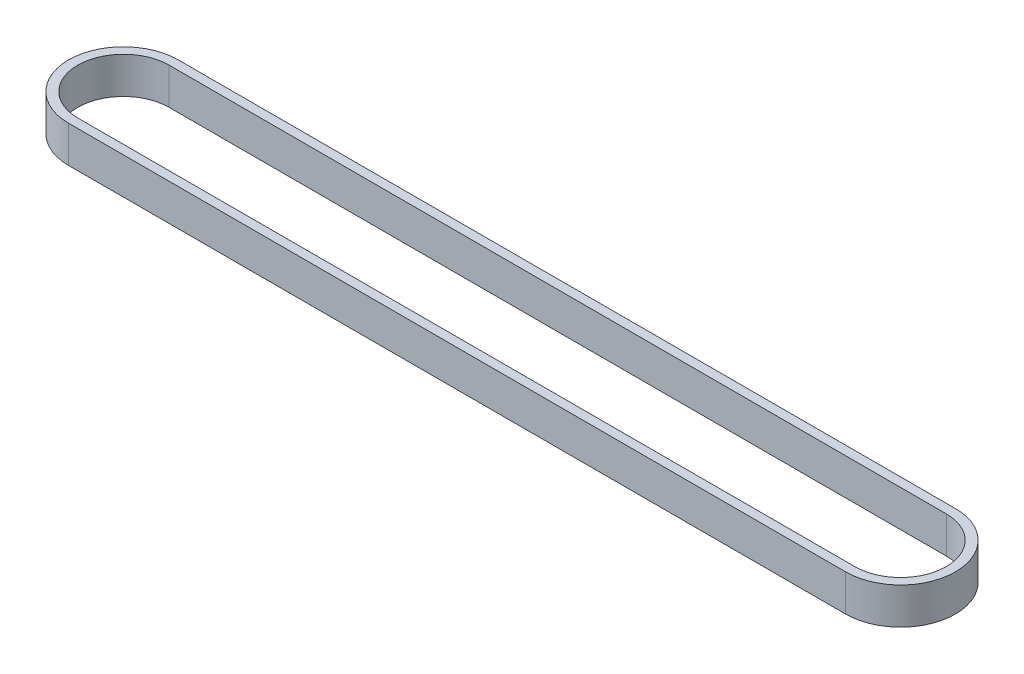
ISO-10303-21;
HEADER;
FILE_DESCRIPTION(('STEP AP214'),'2;1');
FILE_NAME('part.step','',(''),(''),'','','');
FILE_SCHEMA(('AUTOMOTIVE_DESIGN { 1 0 10303 214 1 1 1 1 }'));
ENDSEC;
DATA;
#1=APPLICATION_CONTEXT('core data for automotive mechanical design processes');
#2=APPLICATION_PROTOCOL_DEFINITION('international standard','automotive_design',2000,#1);
#3=PRODUCT_CONTEXT('',#1,'mechanical');
#4=PRODUCT('Part','Part','',(#3));
#5=PRODUCT_RELATED_PRODUCT_CATEGORY('part','',(#4));
#6=PRODUCT_DEFINITION_FORMATION('','',#4);
#7=PRODUCT_DEFINITION_CONTEXT('part definition',#1,'design');
#8=PRODUCT_DEFINITION('design','',#6,#7);
#9=PRODUCT_DEFINITION_SHAPE('','',#8);
#10=(LENGTH_UNIT() NAMED_UNIT(*) SI_UNIT(.MILLI.,.METRE.));
#11=(NAMED_UNIT(*) PLANE_ANGLE_UNIT() SI_UNIT($,.RADIAN.));
#12=(NAMED_UNIT(*) SI_UNIT($,.STERADIAN.) SOLID_ANGLE_UNIT());
#13=UNCERTAINTY_MEASURE_WITH_UNIT(LENGTH_MEASURE(1.E-05),#10,'distance_accuracy_value','');
#14=(GEOMETRIC_REPRESENTATION_CONTEXT(3) GLOBAL_UNCERTAINTY_ASSIGNED_CONTEXT((#13)) GLOBAL_UNIT_ASSIGNED_CONTEXT((#10,
#11,#12)) REPRESENTATION_CONTEXT('',''));
#15=CARTESIAN_POINT('',(0.,0.,0.));
#16=DIRECTION('',(0.,0.,1.));
#17=DIRECTION('',(1.,0.,0.));
#18=AXIS2_PLACEMENT_3D('',#15,#16,#17);
#19=CARTESIAN_POINT('',(-399.023443954952,20.,-11.0209611195785));
#20=DIRECTION('',(0.,-1.,0.));
#21=DIRECTION('',(0.,0.,-1.));
#22=AXIS2_PLACEMENT_3D('',#19,#20,#21);
#23=PLANE('',#22);
#24=CARTESIAN_POINT('',(-399.023443954952,20.,-11.0209611195785));
#25=DIRECTION('',(0.,1.,0.));
#26=DIRECTION('',(0.,0.,-1.));
#27=AXIS2_PLACEMENT_3D('',#24,#25,#26);
#28=CIRCLE('',#27,30.);
#29=CARTESIAN_POINT('',(-399.023443954952,20.,-41.0209611195785));
#30=VERTEX_POINT('',#29);
#31=CARTESIAN_POINT('',(-399.023443954952,20.,18.9790388804215));
#32=VERTEX_POINT('',#31);
#33=EDGE_CURVE('E134',#30,#32,#28,.T.);
#34=ORIENTED_EDGE('',*,*,#33,.T.);
#35=DIRECTION('',(1.,0.,0.));
#36=VECTOR('',#35,1.);
#37=CARTESIAN_POINT('',(-399.023443954952,20.,18.9790388804215));
#38=LINE('',#37,#36);
#39=CARTESIAN_POINT('',(25.9765560450475,20.,18.9790388804215));
#40=VERTEX_POINT('',#39);
#41=EDGE_CURVE('E137',#32,#40,#38,.T.);
#42=ORIENTED_EDGE('',*,*,#41,.T.);
#43=CARTESIAN_POINT('',(25.9765560450475,20.,-11.0209611195785));
#44=DIRECTION('',(0.,1.,0.));
#45=DIRECTION('',(0.,0.,-1.));
#46=AXIS2_PLACEMENT_3D('',#43,#44,#45);
#47=CIRCLE('',#46,30.);
#48=CARTESIAN_POINT('',(25.9765560450475,20.,-41.0209611195785));
#49=VERTEX_POINT('',#48);
#50=EDGE_CURVE('E140',#40,#49,#47,.T.);
#51=ORIENTED_EDGE('',*,*,#50,.T.);
#52=DIRECTION('',(-1.,0.,0.));
#53=VECTOR('',#52,1.);
#54=CARTESIAN_POINT('',(-399.023443954952,20.,-41.0209611195785));
#55=LINE('',#54,#53);
#56=EDGE_CURVE('E142',#49,#30,#55,.T.);
#57=ORIENTED_EDGE('',*,*,#56,.T.);
#58=EDGE_LOOP('',(#34,#42,#51,#57));
#59=FACE_BOUND('',#58,.T.);
#60=CARTESIAN_POINT('',(-399.023443954952,20.,-11.0209611195785));
#61=DIRECTION('',(0.,1.,0.));
#62=DIRECTION('',(0.,0.,1.));
#63=AXIS2_PLACEMENT_3D('',#60,#61,#62);
#64=CIRCLE('',#63,25.);
#65=CARTESIAN_POINT('',(-399.023443954952,20.,-36.0209611195785));
#66=VERTEX_POINT('',#65);
#67=CARTESIAN_POINT('',(-399.023443954952,20.,13.9790388804215));
#68=VERTEX_POINT('',#67);
#69=EDGE_CURVE('E98',#66,#68,#64,.T.);
#70=ORIENTED_EDGE('',*,*,#69,.F.);
#71=DIRECTION('',(-1.,0.,0.));
#72=VECTOR('',#71,1.);
#73=CARTESIAN_POINT('',(-399.023443954952,20.,-36.0209611195785));
#74=LINE('',#73,#72);
#75=CARTESIAN_POINT('',(25.9765560450475,20.,-36.0209611195785));
#76=VERTEX_POINT('',#75);
#77=EDGE_CURVE('E120',#76,#66,#74,.T.);
#78=ORIENTED_EDGE('',*,*,#77,.F.);
#79=CARTESIAN_POINT('',(25.9765560450475,20.,-11.0209611195785));
#80=DIRECTION('',(0.,1.,0.));
#81=DIRECTION('',(0.,0.,1.));
#82=AXIS2_PLACEMENT_3D('',#79,#80,#81);
#83=CIRCLE('',#82,25.);
#84=CARTESIAN_POINT('',(25.9765560450475,20.,13.9790388804215));
#85=VERTEX_POINT('',#84);
#86=EDGE_CURVE('E118',#85,#76,#83,.T.);
#87=ORIENTED_EDGE('',*,*,#86,.F.);
#88=DIRECTION('',(1.,0.,0.));
#89=VECTOR('',#88,1.);
#90=CARTESIAN_POINT('',(-399.023443954952,20.,13.9790388804215));
#91=LINE('',#90,#89);
#92=EDGE_CURVE('E106',#68,#85,#91,.T.);
#93=ORIENTED_EDGE('',*,*,#92,.F.);
#94=EDGE_LOOP('',(#70,#78,#87,#93));
#95=FACE_BOUND('',#94,.T.);
#96=ADVANCED_FACE('F33',(#59,#95),#23,.F.);
#97=CARTESIAN_POINT('',(-399.023443954952,0.,-11.0209611195785));
#98=DIRECTION('',(0.,-1.,0.));
#99=DIRECTION('',(0.,0.,-1.));
#100=AXIS2_PLACEMENT_3D('',#97,#98,#99);
#101=PLANE('',#100);
#102=CARTESIAN_POINT('',(-399.023443954952,0.,-11.0209611195785));
#103=DIRECTION('',(0.,1.,0.));
#104=DIRECTION('',(0.,0.,-1.));
#105=AXIS2_PLACEMENT_3D('',#102,#103,#104);
#106=CIRCLE('',#105,30.);
#107=CARTESIAN_POINT('',(-399.023443954952,0.,-41.0209611195785));
#108=VERTEX_POINT('',#107);
#109=CARTESIAN_POINT('',(-399.023443954952,0.,18.9790388804215));
#110=VERTEX_POINT('',#109);
#111=EDGE_CURVE('E114',#108,#110,#106,.T.);
#112=ORIENTED_EDGE('',*,*,#111,.F.);
#113=DIRECTION('',(-1.,0.,0.));
#114=VECTOR('',#113,1.);
#115=CARTESIAN_POINT('',(-399.023443954952,0.,-41.0209611195785));
#116=LINE('',#115,#114);
#117=CARTESIAN_POINT('',(25.9765560450475,0.,-41.0209611195785));
#118=VERTEX_POINT('',#117);
#119=EDGE_CURVE('E138',#118,#108,#116,.T.);
#120=ORIENTED_EDGE('',*,*,#119,.F.);
#121=CARTESIAN_POINT('',(25.9765560450475,0.,-11.0209611195785));
#122=DIRECTION('',(0.,1.,0.));
#123=DIRECTION('',(0.,0.,-1.));
#124=AXIS2_PLACEMENT_3D('',#121,#122,#123);
#125=CIRCLE('',#124,30.);
#126=CARTESIAN_POINT('',(25.9765560450475,0.,18.9790388804215));
#127=VERTEX_POINT('',#126);
#128=EDGE_CURVE('E149',#127,#118,#125,.T.);
#129=ORIENTED_EDGE('',*,*,#128,.F.);
#130=DIRECTION('',(1.,0.,0.));
#131=VECTOR('',#130,1.);
#132=CARTESIAN_POINT('',(-399.023443954952,0.,18.9790388804215));
#133=LINE('',#132,#131);
#134=EDGE_CURVE('E147',#110,#127,#133,.T.);
#135=ORIENTED_EDGE('',*,*,#134,.F.);
#136=EDGE_LOOP('',(#112,#120,#129,#135));
#137=FACE_BOUND('',#136,.T.);
#138=DIRECTION('',(-1.,0.,0.));
#139=VECTOR('',#138,1.);
#140=CARTESIAN_POINT('',(-399.023443954952,0.,-36.0209611195785));
#141=LINE('',#140,#139);
#142=CARTESIAN_POINT('',(25.9765560450475,0.,-36.0209611195785));
#143=VERTEX_POINT('',#142);
#144=CARTESIAN_POINT('',(-399.023443954952,0.,-36.0209611195785));
#145=VERTEX_POINT('',#144);
#146=EDGE_CURVE('E107',#143,#145,#141,.T.);
#147=ORIENTED_EDGE('',*,*,#146,.T.);
#148=CARTESIAN_POINT('',(-399.023443954952,0.,-11.0209611195785));
#149=DIRECTION('',(0.,1.,0.));
#150=DIRECTION('',(0.,0.,1.));
#151=AXIS2_PLACEMENT_3D('',#148,#149,#150);
#152=CIRCLE('',#151,25.);
#153=CARTESIAN_POINT('',(-399.023443954952,0.,13.9790388804215));
#154=VERTEX_POINT('',#153);
#155=EDGE_CURVE('E56',#145,#154,#152,.T.);
#156=ORIENTED_EDGE('',*,*,#155,.T.);
#157=DIRECTION('',(1.,0.,0.));
#158=VECTOR('',#157,1.);
#159=CARTESIAN_POINT('',(-399.023443954952,0.,13.9790388804215));
#160=LINE('',#159,#158);
#161=CARTESIAN_POINT('',(25.9765560450475,0.,13.9790388804215));
#162=VERTEX_POINT('',#161);
#163=EDGE_CURVE('E113',#154,#162,#160,.T.);
#164=ORIENTED_EDGE('',*,*,#163,.T.);
#165=CARTESIAN_POINT('',(25.9765560450475,0.,-11.0209611195785));
#166=DIRECTION('',(0.,1.,0.));
#167=DIRECTION('',(0.,0.,1.));
#168=AXIS2_PLACEMENT_3D('',#165,#166,#167);
#169=CIRCLE('',#168,25.);
#170=EDGE_CURVE('E126',#162,#143,#169,.T.);
#171=ORIENTED_EDGE('',*,*,#170,.T.);
#172=EDGE_LOOP('',(#147,#156,#164,#171));
#173=FACE_BOUND('',#172,.T.);
#174=ADVANCED_FACE('F167',(#137,#173),#101,.T.);
#175=CARTESIAN_POINT('',(-399.023443954952,20.,-11.0209611195785));
#176=DIRECTION('',(0.,-1.,0.));
#177=DIRECTION('',(0.,0.,-1.));
#178=AXIS2_PLACEMENT_3D('',#175,#176,#177);
#179=CYLINDRICAL_SURFACE('',#178,30.);
#180=ORIENTED_EDGE('',*,*,#111,.T.);
#181=DIRECTION('',(0.,-1.,0.));
#182=VECTOR('',#181,1.);
#183=CARTESIAN_POINT('',(-399.023443954952,20.,18.9790388804215));
#184=LINE('',#183,#182);
#185=EDGE_CURVE('E11',#32,#110,#184,.T.);
#186=ORIENTED_EDGE('',*,*,#185,.F.);
#187=ORIENTED_EDGE('',*,*,#33,.F.);
#188=DIRECTION('',(0.,-1.,0.));
#189=VECTOR('',#188,1.);
#190=CARTESIAN_POINT('',(-399.023443954952,20.,-41.0209611195785));
#191=LINE('',#190,#189);
#192=EDGE_CURVE('E144',#30,#108,#191,.T.);
#193=ORIENTED_EDGE('',*,*,#192,.T.);
#194=EDGE_LOOP('',(#180,#186,#187,#193));
#195=FACE_BOUND('',#194,.T.);
#196=ADVANCED_FACE('F35',(#195),#179,.T.);
#197=CARTESIAN_POINT('',(-399.023443954952,20.,18.9790388804215));
#198=DIRECTION('',(0.,0.,-1.));
#199=DIRECTION('',(-1.,0.,0.));
#200=AXIS2_PLACEMENT_3D('',#197,#198,#199);
#201=PLANE('',#200);
#202=ORIENTED_EDGE('',*,*,#134,.T.);
#203=DIRECTION('',(0.,-1.,0.));
#204=VECTOR('',#203,1.);
#205=CARTESIAN_POINT('',(25.9765560450475,20.,18.9790388804215));
#206=LINE('',#205,#204);
#207=EDGE_CURVE('E41',#40,#127,#206,.T.);
#208=ORIENTED_EDGE('',*,*,#207,.F.);
#209=ORIENTED_EDGE('',*,*,#41,.F.);
#210=ORIENTED_EDGE('',*,*,#185,.T.);
#211=EDGE_LOOP('',(#202,#208,#209,#210));
#212=FACE_BOUND('',#211,.T.);
#213=ADVANCED_FACE('F177',(#212),#201,.F.);
#214=CARTESIAN_POINT('',(25.9765560450475,20.,-11.0209611195785));
#215=DIRECTION('',(0.,-1.,0.));
#216=DIRECTION('',(0.,0.,-1.));
#217=AXIS2_PLACEMENT_3D('',#214,#215,#216);
#218=CYLINDRICAL_SURFACE('',#217,30.);
#219=ORIENTED_EDGE('',*,*,#128,.T.);
#220=DIRECTION('',(0.,-1.,0.));
#221=VECTOR('',#220,1.);
#222=CARTESIAN_POINT('',(25.9765560450475,20.,-41.0209611195785));
#223=LINE('',#222,#221);
#224=EDGE_CURVE('E154',#49,#118,#223,.T.);
#225=ORIENTED_EDGE('',*,*,#224,.F.);
#226=ORIENTED_EDGE('',*,*,#50,.F.);
#227=ORIENTED_EDGE('',*,*,#207,.T.);
#228=EDGE_LOOP('',(#219,#225,#226,#227));
#229=FACE_BOUND('',#228,.T.);
#230=ADVANCED_FACE('F161',(#229),#218,.T.);
#231=CARTESIAN_POINT('',(-399.023443954952,20.,-41.0209611195785));
#232=DIRECTION('',(0.,0.,1.));
#233=DIRECTION('',(1.,0.,0.));
#234=AXIS2_PLACEMENT_3D('',#231,#232,#233);
#235=PLANE('',#234);
#236=ORIENTED_EDGE('',*,*,#119,.T.);
#237=ORIENTED_EDGE('',*,*,#192,.F.);
#238=ORIENTED_EDGE('',*,*,#56,.F.);
#239=ORIENTED_EDGE('',*,*,#224,.T.);
#240=EDGE_LOOP('',(#236,#237,#238,#239));
#241=FACE_BOUND('',#240,.T.);
#242=ADVANCED_FACE('F171',(#241),#235,.F.);
#243=CARTESIAN_POINT('',(-399.023443954952,20.,-11.0209611195785));
#244=DIRECTION('',(0.,-1.,0.));
#245=DIRECTION('',(0.,0.,-1.));
#246=AXIS2_PLACEMENT_3D('',#243,#244,#245);
#247=CYLINDRICAL_SURFACE('',#246,25.);
#248=ORIENTED_EDGE('',*,*,#155,.F.);
#249=DIRECTION('',(0.,-1.,0.));
#250=VECTOR('',#249,1.);
#251=CARTESIAN_POINT('',(-399.023443954952,20.,-36.0209611195785));
#252=LINE('',#251,#250);
#253=EDGE_CURVE('E102',#66,#145,#252,.T.);
#254=ORIENTED_EDGE('',*,*,#253,.F.);
#255=ORIENTED_EDGE('',*,*,#69,.T.);
#256=DIRECTION('',(0.,-1.,0.));
#257=VECTOR('',#256,1.);
#258=CARTESIAN_POINT('',(-399.023443954952,20.,13.9790388804215));
#259=LINE('',#258,#257);
#260=EDGE_CURVE('E101',#68,#154,#259,.T.);
#261=ORIENTED_EDGE('',*,*,#260,.T.);
#262=EDGE_LOOP('',(#248,#254,#255,#261));
#263=FACE_BOUND('',#262,.T.);
#264=ADVANCED_FACE('F100',(#263),#247,.F.);
#265=CARTESIAN_POINT('',(-399.023443954952,20.,13.9790388804215));
#266=DIRECTION('',(0.,0.,-1.));
#267=DIRECTION('',(-1.,0.,0.));
#268=AXIS2_PLACEMENT_3D('',#265,#266,#267);
#269=PLANE('',#268);
#270=ORIENTED_EDGE('',*,*,#163,.F.);
#271=ORIENTED_EDGE('',*,*,#260,.F.);
#272=ORIENTED_EDGE('',*,*,#92,.T.);
#273=DIRECTION('',(0.,-1.,0.));
#274=VECTOR('',#273,1.);
#275=CARTESIAN_POINT('',(25.9765560450475,20.,13.9790388804215));
#276=LINE('',#275,#274);
#277=EDGE_CURVE('E115',#85,#162,#276,.T.);
#278=ORIENTED_EDGE('',*,*,#277,.T.);
#279=EDGE_LOOP('',(#270,#271,#272,#278));
#280=FACE_BOUND('',#279,.T.);
#281=ADVANCED_FACE('F110',(#280),#269,.T.);
#282=CARTESIAN_POINT('',(25.9765560450475,20.,-11.0209611195785));
#283=DIRECTION('',(0.,-1.,0.));
#284=DIRECTION('',(0.,0.,-1.));
#285=AXIS2_PLACEMENT_3D('',#282,#283,#284);
#286=CYLINDRICAL_SURFACE('',#285,25.);
#287=ORIENTED_EDGE('',*,*,#170,.F.);
#288=ORIENTED_EDGE('',*,*,#277,.F.);
#289=ORIENTED_EDGE('',*,*,#86,.T.);
#290=DIRECTION('',(0.,-1.,0.));
#291=VECTOR('',#290,1.);
#292=CARTESIAN_POINT('',(25.9765560450475,20.,-36.0209611195785));
#293=LINE('',#292,#291);
#294=EDGE_CURVE('E48',#76,#143,#293,.T.);
#295=ORIENTED_EDGE('',*,*,#294,.T.);
#296=EDGE_LOOP('',(#287,#288,#289,#295));
#297=FACE_BOUND('',#296,.T.);
#298=ADVANCED_FACE('F200',(#297),#286,.F.);
#299=CARTESIAN_POINT('',(-399.023443954952,20.,-36.0209611195785));
#300=DIRECTION('',(0.,0.,1.));
#301=DIRECTION('',(1.,0.,0.));
#302=AXIS2_PLACEMENT_3D('',#299,#300,#301);
#303=PLANE('',#302);
#304=ORIENTED_EDGE('',*,*,#146,.F.);
#305=ORIENTED_EDGE('',*,*,#294,.F.);
#306=ORIENTED_EDGE('',*,*,#77,.T.);
#307=ORIENTED_EDGE('',*,*,#253,.T.);
#308=EDGE_LOOP('',(#304,#305,#306,#307));
#309=FACE_BOUND('',#308,.T.);
#310=ADVANCED_FACE('F204',(#309),#303,.T.);
#311=CLOSED_SHELL('',(#96,#174,#196,#213,#230,#242,#264,#281,#298,#310));
#312=MANIFOLD_SOLID_BREP('B2',#311);
#313=ADVANCED_BREP_SHAPE_REPRESENTATION('',(#18,#312),#14);
#314=SHAPE_DEFINITION_REPRESENTATION(#9,#313);
ENDSEC;
END-ISO-10303-21;
